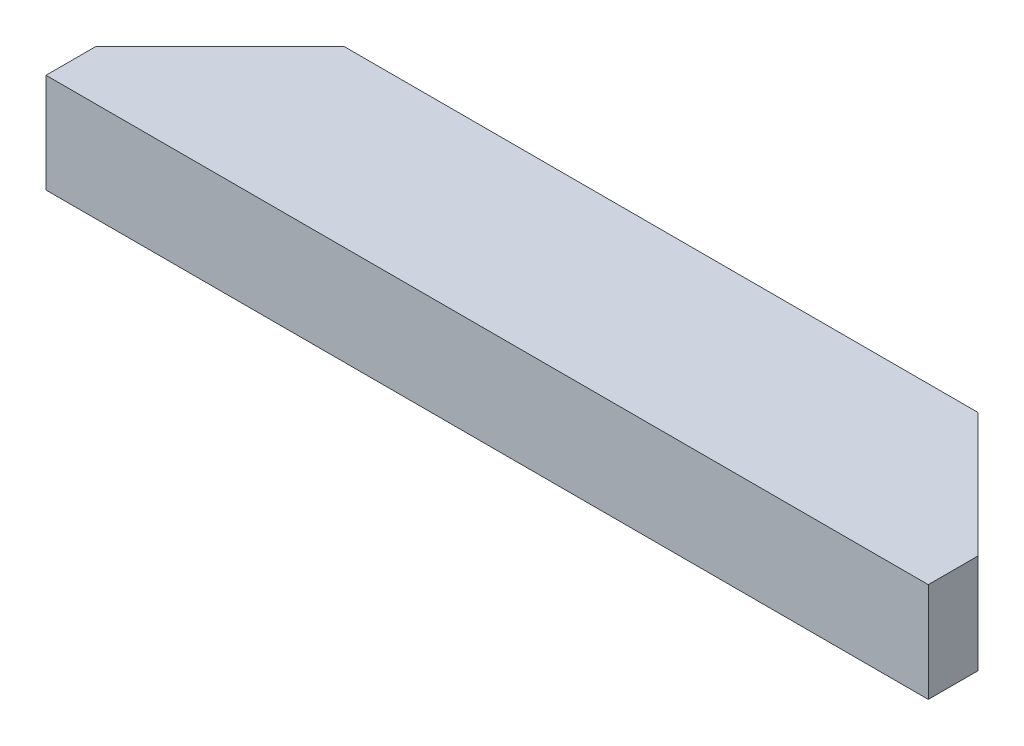
ISO-10303-21;
HEADER;
FILE_DESCRIPTION(('STEP AP214'),'2;1');
FILE_NAME('part.step','',(''),(''),'','','');
FILE_SCHEMA(('AUTOMOTIVE_DESIGN { 1 0 10303 214 1 1 1 1 }'));
ENDSEC;
DATA;
#1=APPLICATION_CONTEXT('core data for automotive mechanical design processes');
#2=APPLICATION_PROTOCOL_DEFINITION('international standard','automotive_design',2000,#1);
#3=PRODUCT_CONTEXT('',#1,'mechanical');
#4=PRODUCT('Part','Part','',(#3));
#5=PRODUCT_RELATED_PRODUCT_CATEGORY('part','',(#4));
#6=PRODUCT_DEFINITION_FORMATION('','',#4);
#7=PRODUCT_DEFINITION_CONTEXT('part definition',#1,'design');
#8=PRODUCT_DEFINITION('design','',#6,#7);
#9=PRODUCT_DEFINITION_SHAPE('','',#8);
#10=(LENGTH_UNIT() NAMED_UNIT(*) SI_UNIT(.MILLI.,.METRE.));
#11=(NAMED_UNIT(*) PLANE_ANGLE_UNIT() SI_UNIT($,.RADIAN.));
#12=(NAMED_UNIT(*) SI_UNIT($,.STERADIAN.) SOLID_ANGLE_UNIT());
#13=UNCERTAINTY_MEASURE_WITH_UNIT(LENGTH_MEASURE(1.E-05),#10,'distance_accuracy_value','');
#14=(GEOMETRIC_REPRESENTATION_CONTEXT(3) GLOBAL_UNCERTAINTY_ASSIGNED_CONTEXT((#13)) GLOBAL_UNIT_ASSIGNED_CONTEXT((#10,
#11,#12)) REPRESENTATION_CONTEXT('',''));
#15=CARTESIAN_POINT('',(0.,0.,0.));
#16=DIRECTION('',(0.,0.,1.));
#17=DIRECTION('',(1.,0.,0.));
#18=AXIS2_PLACEMENT_3D('',#15,#16,#17);
#19=CARTESIAN_POINT('',(225.425,25.4,44.45));
#20=DIRECTION('',(-1.,0.,0.));
#21=DIRECTION('',(0.,0.,1.));
#22=AXIS2_PLACEMENT_3D('',#19,#20,#21);
#23=PLANE('',#22);
#24=DIRECTION('',(0.,0.,-1.));
#25=VECTOR('',#24,1.);
#26=CARTESIAN_POINT('',(225.425,-25.4,44.45));
#27=LINE('',#26,#25);
#28=CARTESIAN_POINT('',(225.425,-25.4,44.45));
#29=VERTEX_POINT('',#28);
#30=CARTESIAN_POINT('',(225.425,-25.4,19.05));
#31=VERTEX_POINT('',#30);
#32=EDGE_CURVE('E121',#29,#31,#27,.T.);
#33=ORIENTED_EDGE('',*,*,#32,.T.);
#34=DIRECTION('',(0.,1.,0.));
#35=VECTOR('',#34,1.);
#36=CARTESIAN_POINT('',(225.425,-25.4,19.0499999999999));
#37=LINE('',#36,#35);
#38=CARTESIAN_POINT('',(225.425,25.4,19.0499999999999));
#39=VERTEX_POINT('',#38);
#40=EDGE_CURVE('E68',#31,#39,#37,.T.);
#41=ORIENTED_EDGE('',*,*,#40,.T.);
#42=DIRECTION('',(0.,0.,-1.));
#43=VECTOR('',#42,1.);
#44=CARTESIAN_POINT('',(225.425,25.4,44.45));
#45=LINE('',#44,#43);
#46=CARTESIAN_POINT('',(225.425,25.4,44.45));
#47=VERTEX_POINT('',#46);
#48=EDGE_CURVE('E131',#47,#39,#45,.T.);
#49=ORIENTED_EDGE('',*,*,#48,.F.);
#50=DIRECTION('',(0.,-1.,0.));
#51=VECTOR('',#50,1.);
#52=CARTESIAN_POINT('',(225.425,25.4,44.45));
#53=LINE('',#52,#51);
#54=EDGE_CURVE('E53',#47,#29,#53,.T.);
#55=ORIENTED_EDGE('',*,*,#54,.T.);
#56=EDGE_LOOP('',(#33,#41,#49,#55));
#57=FACE_BOUND('',#56,.T.);
#58=ADVANCED_FACE('F45',(#57),#23,.F.);
#59=CARTESIAN_POINT('',(-225.425,25.4,-44.45));
#60=DIRECTION('',(0.,0.,1.));
#61=DIRECTION('',(1.,0.,0.));
#62=AXIS2_PLACEMENT_3D('',#59,#60,#61);
#63=PLANE('',#62);
#64=DIRECTION('',(-1.,0.,0.));
#65=VECTOR('',#64,1.);
#66=CARTESIAN_POINT('',(-225.425,25.4,-44.45));
#67=LINE('',#66,#65);
#68=CARTESIAN_POINT('',(161.924999999999,25.4,-44.4500000000001));
#69=VERTEX_POINT('',#68);
#70=CARTESIAN_POINT('',(-161.924999999999,25.4,-44.45));
#71=VERTEX_POINT('',#70);
#72=EDGE_CURVE('E113',#69,#71,#67,.T.);
#73=ORIENTED_EDGE('',*,*,#72,.F.);
#74=DIRECTION('',(0.,1.,0.));
#75=VECTOR('',#74,1.);
#76=CARTESIAN_POINT('',(161.924999999999,-25.4,-44.4500000000001));
#77=LINE('',#76,#75);
#78=CARTESIAN_POINT('',(161.924999999999,-25.4,-44.4500000000001));
#79=VERTEX_POINT('',#78);
#80=EDGE_CURVE('E98',#79,#69,#77,.T.);
#81=ORIENTED_EDGE('',*,*,#80,.F.);
#82=DIRECTION('',(-1.,0.,0.));
#83=VECTOR('',#82,1.);
#84=CARTESIAN_POINT('',(-225.425,-25.4,-44.45));
#85=LINE('',#84,#83);
#86=CARTESIAN_POINT('',(-161.924999999999,-25.4,-44.45));
#87=VERTEX_POINT('',#86);
#88=EDGE_CURVE('E111',#79,#87,#85,.T.);
#89=ORIENTED_EDGE('',*,*,#88,.T.);
#90=DIRECTION('',(0.,1.,0.));
#91=VECTOR('',#90,1.);
#92=CARTESIAN_POINT('',(-161.924999999999,-25.4,-44.45));
#93=LINE('',#92,#91);
#94=EDGE_CURVE('E60',#87,#71,#93,.T.);
#95=ORIENTED_EDGE('',*,*,#94,.T.);
#96=EDGE_LOOP('',(#73,#81,#89,#95));
#97=FACE_BOUND('',#96,.T.);
#98=ADVANCED_FACE('F110',(#97),#63,.F.);
#99=CARTESIAN_POINT('',(-225.425,25.4,44.45));
#100=DIRECTION('',(1.,0.,0.));
#101=DIRECTION('',(0.,0.,-1.));
#102=AXIS2_PLACEMENT_3D('',#99,#100,#101);
#103=PLANE('',#102);
#104=DIRECTION('',(0.,0.,1.));
#105=VECTOR('',#104,1.);
#106=CARTESIAN_POINT('',(-225.425,25.4,44.45));
#107=LINE('',#106,#105);
#108=CARTESIAN_POINT('',(-225.425,25.4,19.05));
#109=VERTEX_POINT('',#108);
#110=CARTESIAN_POINT('',(-225.425,25.4,44.45));
#111=VERTEX_POINT('',#110);
#112=EDGE_CURVE('E139',#109,#111,#107,.T.);
#113=ORIENTED_EDGE('',*,*,#112,.F.);
#114=DIRECTION('',(0.,1.,0.));
#115=VECTOR('',#114,1.);
#116=CARTESIAN_POINT('',(-225.425,-25.4,19.05));
#117=LINE('',#116,#115);
#118=CARTESIAN_POINT('',(-225.425,-25.4,19.05));
#119=VERTEX_POINT('',#118);
#120=EDGE_CURVE('E153',#119,#109,#117,.T.);
#121=ORIENTED_EDGE('',*,*,#120,.F.);
#122=DIRECTION('',(0.,0.,1.));
#123=VECTOR('',#122,1.);
#124=CARTESIAN_POINT('',(-225.425,-25.4,44.45));
#125=LINE('',#124,#123);
#126=CARTESIAN_POINT('',(-225.425,-25.4,44.45));
#127=VERTEX_POINT('',#126);
#128=EDGE_CURVE('E120',#119,#127,#125,.T.);
#129=ORIENTED_EDGE('',*,*,#128,.T.);
#130=DIRECTION('',(0.,-1.,0.));
#131=VECTOR('',#130,1.);
#132=CARTESIAN_POINT('',(-225.425,25.4,44.45));
#133=LINE('',#132,#131);
#134=EDGE_CURVE('E11',#111,#127,#133,.T.);
#135=ORIENTED_EDGE('',*,*,#134,.F.);
#136=EDGE_LOOP('',(#113,#121,#129,#135));
#137=FACE_BOUND('',#136,.T.);
#138=ADVANCED_FACE('F173',(#137),#103,.F.);
#139=CARTESIAN_POINT('',(-225.425,25.4,44.45));
#140=DIRECTION('',(0.,0.,-1.));
#141=DIRECTION('',(-1.,0.,0.));
#142=AXIS2_PLACEMENT_3D('',#139,#140,#141);
#143=PLANE('',#142);
#144=DIRECTION('',(1.,0.,0.));
#145=VECTOR('',#144,1.);
#146=CARTESIAN_POINT('',(-225.425,-25.4,44.45));
#147=LINE('',#146,#145);
#148=EDGE_CURVE('E125',#127,#29,#147,.T.);
#149=ORIENTED_EDGE('',*,*,#148,.T.);
#150=ORIENTED_EDGE('',*,*,#54,.F.);
#151=DIRECTION('',(1.,0.,0.));
#152=VECTOR('',#151,1.);
#153=CARTESIAN_POINT('',(-225.425,25.4,44.45));
#154=LINE('',#153,#152);
#155=EDGE_CURVE('E134',#111,#47,#154,.T.);
#156=ORIENTED_EDGE('',*,*,#155,.F.);
#157=ORIENTED_EDGE('',*,*,#134,.T.);
#158=EDGE_LOOP('',(#149,#150,#156,#157));
#159=FACE_BOUND('',#158,.T.);
#160=ADVANCED_FACE('F165',(#159),#143,.F.);
#161=CARTESIAN_POINT('',(0.,25.4,0.));
#162=DIRECTION('',(0.,-1.,0.));
#163=DIRECTION('',(0.,0.,-1.));
#164=AXIS2_PLACEMENT_3D('',#161,#162,#163);
#165=PLANE('',#164);
#166=ORIENTED_EDGE('',*,*,#48,.T.);
#167=DIRECTION('',(0.707106781186552,0.,0.707106781186543));
#168=VECTOR('',#167,1.);
#169=CARTESIAN_POINT('',(225.425,25.4,19.0499999999999));
#170=LINE('',#169,#168);
#171=EDGE_CURVE('E105',#69,#39,#170,.T.);
#172=ORIENTED_EDGE('',*,*,#171,.F.);
#173=ORIENTED_EDGE('',*,*,#72,.T.);
#174=DIRECTION('',(0.707106781186552,0.,-0.707106781186543));
#175=VECTOR('',#174,1.);
#176=CARTESIAN_POINT('',(-225.425,25.4,19.05));
#177=LINE('',#176,#175);
#178=EDGE_CURVE('E152',#109,#71,#177,.T.);
#179=ORIENTED_EDGE('',*,*,#178,.F.);
#180=ORIENTED_EDGE('',*,*,#112,.T.);
#181=ORIENTED_EDGE('',*,*,#155,.T.);
#182=EDGE_LOOP('',(#166,#172,#173,#179,#180,#181));
#183=FACE_BOUND('',#182,.T.);
#184=ADVANCED_FACE('F163',(#183),#165,.F.);
#185=CARTESIAN_POINT('',(0.,-25.4,0.));
#186=DIRECTION('',(0.,-1.,0.));
#187=DIRECTION('',(0.,0.,-1.));
#188=AXIS2_PLACEMENT_3D('',#185,#186,#187);
#189=PLANE('',#188);
#190=DIRECTION('',(0.707106781186552,0.,0.707106781186543));
#191=VECTOR('',#190,1.);
#192=CARTESIAN_POINT('',(225.425,-25.4,19.0499999999999));
#193=LINE('',#192,#191);
#194=EDGE_CURVE('E95',#79,#31,#193,.T.);
#195=ORIENTED_EDGE('',*,*,#194,.T.);
#196=ORIENTED_EDGE('',*,*,#32,.F.);
#197=ORIENTED_EDGE('',*,*,#148,.F.);
#198=ORIENTED_EDGE('',*,*,#128,.F.);
#199=DIRECTION('',(0.707106781186552,0.,-0.707106781186543));
#200=VECTOR('',#199,1.);
#201=CARTESIAN_POINT('',(-225.425,-25.4,19.05));
#202=LINE('',#201,#200);
#203=EDGE_CURVE('E118',#119,#87,#202,.T.);
#204=ORIENTED_EDGE('',*,*,#203,.T.);
#205=ORIENTED_EDGE('',*,*,#88,.F.);
#206=EDGE_LOOP('',(#195,#196,#197,#198,#204,#205));
#207=FACE_BOUND('',#206,.T.);
#208=ADVANCED_FACE('F116',(#207),#189,.T.);
#209=CARTESIAN_POINT('',(-225.425,-25.4,19.05));
#210=DIRECTION('',(0.707106781186543,0.,0.707106781186552));
#211=DIRECTION('',(0.707106781186552,0.,-0.707106781186543));
#212=AXIS2_PLACEMENT_3D('',#209,#210,#211);
#213=PLANE('',#212);
#214=ORIENTED_EDGE('',*,*,#178,.T.);
#215=ORIENTED_EDGE('',*,*,#94,.F.);
#216=ORIENTED_EDGE('',*,*,#203,.F.);
#217=ORIENTED_EDGE('',*,*,#120,.T.);
#218=EDGE_LOOP('',(#214,#215,#216,#217));
#219=FACE_BOUND('',#218,.T.);
#220=ADVANCED_FACE('F171',(#219),#213,.F.);
#221=CARTESIAN_POINT('',(225.425,-25.4,19.0499999999999));
#222=DIRECTION('',(-0.707106781186543,0.,0.707106781186552));
#223=DIRECTION('',(0.707106781186552,0.,0.707106781186543));
#224=AXIS2_PLACEMENT_3D('',#221,#222,#223);
#225=PLANE('',#224);
#226=ORIENTED_EDGE('',*,*,#171,.T.);
#227=ORIENTED_EDGE('',*,*,#40,.F.);
#228=ORIENTED_EDGE('',*,*,#194,.F.);
#229=ORIENTED_EDGE('',*,*,#80,.T.);
#230=EDGE_LOOP('',(#226,#227,#228,#229));
#231=FACE_BOUND('',#230,.T.);
#232=ADVANCED_FACE('F97',(#231),#225,.F.);
#233=CLOSED_SHELL('',(#58,#98,#138,#160,#184,#208,#220,#232));
#234=MANIFOLD_SOLID_BREP('B2',#233);
#235=ADVANCED_BREP_SHAPE_REPRESENTATION('',(#18,#234),#14);
#236=SHAPE_DEFINITION_REPRESENTATION(#9,#235);
ENDSEC;
END-ISO-10303-21;
